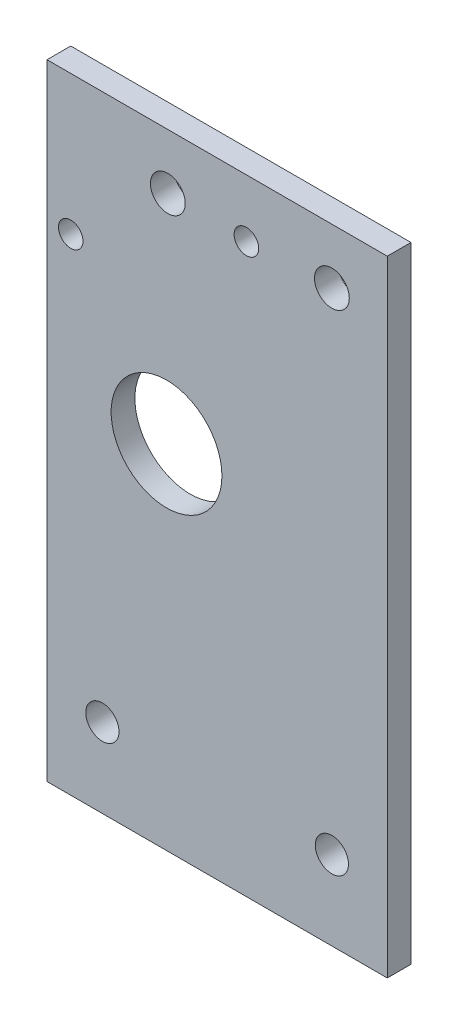
ISO-10303-21;
HEADER;
FILE_DESCRIPTION(('STEP AP214'),'2;1');
FILE_NAME('part.step','',(''),(''),'','','');
FILE_SCHEMA(('AUTOMOTIVE_DESIGN { 1 0 10303 214 1 1 1 1 }'));
ENDSEC;
DATA;
#1=APPLICATION_CONTEXT('core data for automotive mechanical design processes');
#2=APPLICATION_PROTOCOL_DEFINITION('international standard','automotive_design',2000,#1);
#3=PRODUCT_CONTEXT('',#1,'mechanical');
#4=PRODUCT('Part','Part','',(#3));
#5=PRODUCT_RELATED_PRODUCT_CATEGORY('part','',(#4));
#6=PRODUCT_DEFINITION_FORMATION('','',#4);
#7=PRODUCT_DEFINITION_CONTEXT('part definition',#1,'design');
#8=PRODUCT_DEFINITION('design','',#6,#7);
#9=PRODUCT_DEFINITION_SHAPE('','',#8);
#10=(LENGTH_UNIT() NAMED_UNIT(*) SI_UNIT(.MILLI.,.METRE.));
#11=(NAMED_UNIT(*) PLANE_ANGLE_UNIT() SI_UNIT($,.RADIAN.));
#12=(NAMED_UNIT(*) SI_UNIT($,.STERADIAN.) SOLID_ANGLE_UNIT());
#13=UNCERTAINTY_MEASURE_WITH_UNIT(LENGTH_MEASURE(1.E-05),#10,'distance_accuracy_value','');
#14=(GEOMETRIC_REPRESENTATION_CONTEXT(3) GLOBAL_UNCERTAINTY_ASSIGNED_CONTEXT((#13)) GLOBAL_UNIT_ASSIGNED_CONTEXT((#10,
#11,#12)) REPRESENTATION_CONTEXT('',''));
#15=CARTESIAN_POINT('',(0.,0.,0.));
#16=DIRECTION('',(0.,0.,1.));
#17=DIRECTION('',(1.,0.,0.));
#18=AXIS2_PLACEMENT_3D('',#15,#16,#17);
#19=CARTESIAN_POINT('',(0.,0.,3.));
#20=DIRECTION('',(0.,0.,1.));
#21=DIRECTION('',(1.,0.,0.));
#22=AXIS2_PLACEMENT_3D('',#19,#20,#21);
#23=PLANE('',#22);
#24=CARTESIAN_POINT('',(24.,16.9055371087257,3.));
#25=DIRECTION('',(0.,0.,-1.));
#26=DIRECTION('',(-1.,0.,0.));
#27=AXIS2_PLACEMENT_3D('',#24,#25,#26);
#28=CIRCLE('',#27,1.55);
#29=CARTESIAN_POINT('',(22.45,16.9055371087257,3.));
#30=VERTEX_POINT('',#29);
#31=EDGE_CURVE('E120',#30,#30,#28,.T.);
#32=ORIENTED_EDGE('',*,*,#31,.T.);
#33=EDGE_LOOP('',(#32));
#34=FACE_BOUND('',#33,.T.);
#35=CARTESIAN_POINT('',(46.2,27.2055371087257,3.));
#36=DIRECTION('',(0.,0.,-1.));
#37=DIRECTION('',(-1.,0.,0.));
#38=AXIS2_PLACEMENT_3D('',#35,#36,#37);
#39=CIRCLE('',#38,1.55);
#40=CARTESIAN_POINT('',(44.65,27.2055371087257,3.));
#41=VERTEX_POINT('',#40);
#42=EDGE_CURVE('E126',#41,#41,#39,.T.);
#43=ORIENTED_EDGE('',*,*,#42,.T.);
#44=EDGE_LOOP('',(#43));
#45=FACE_BOUND('',#44,.T.);
#46=CARTESIAN_POINT('',(36.27,27.5,3.));
#47=DIRECTION('',(0.,0.,1.));
#48=DIRECTION('',(1.,0.,0.));
#49=AXIS2_PLACEMENT_3D('',#46,#47,#48);
#50=CIRCLE('',#49,2.2);
#51=CARTESIAN_POINT('',(38.47,27.5,3.));
#52=VERTEX_POINT('',#51);
#53=EDGE_CURVE('E82',#52,#52,#50,.T.);
#54=ORIENTED_EDGE('',*,*,#53,.F.);
#55=EDGE_LOOP('',(#54));
#56=FACE_BOUND('',#55,.T.);
#57=CARTESIAN_POINT('',(57.0000000000001,27.5,3.));
#58=DIRECTION('',(0.,0.,1.));
#59=DIRECTION('',(1.,0.,0.));
#60=AXIS2_PLACEMENT_3D('',#57,#58,#59);
#61=CIRCLE('',#60,2.2);
#62=CARTESIAN_POINT('',(59.2000000000001,27.5,3.));
#63=VERTEX_POINT('',#62);
#64=EDGE_CURVE('E136',#63,#63,#61,.T.);
#65=ORIENTED_EDGE('',*,*,#64,.F.);
#66=EDGE_LOOP('',(#65));
#67=FACE_BOUND('',#66,.T.);
#68=CARTESIAN_POINT('',(28.,-34.5,3.));
#69=DIRECTION('',(0.,0.,1.));
#70=DIRECTION('',(1.,0.,0.));
#71=AXIS2_PLACEMENT_3D('',#68,#69,#70);
#72=CIRCLE('',#71,2.1);
#73=CARTESIAN_POINT('',(30.1,-34.5,3.));
#74=VERTEX_POINT('',#73);
#75=EDGE_CURVE('E116',#74,#74,#72,.T.);
#76=ORIENTED_EDGE('',*,*,#75,.F.);
#77=EDGE_LOOP('',(#76));
#78=FACE_BOUND('',#77,.T.);
#79=CARTESIAN_POINT('',(57.,-34.5,3.));
#80=DIRECTION('',(0.,0.,1.));
#81=DIRECTION('',(1.,0.,0.));
#82=AXIS2_PLACEMENT_3D('',#79,#80,#81);
#83=CIRCLE('',#82,2.1);
#84=CARTESIAN_POINT('',(59.1,-34.5,3.));
#85=VERTEX_POINT('',#84);
#86=EDGE_CURVE('E145',#85,#85,#83,.T.);
#87=ORIENTED_EDGE('',*,*,#86,.F.);
#88=EDGE_LOOP('',(#87));
#89=FACE_BOUND('',#88,.T.);
#90=CARTESIAN_POINT('',(36.1057978598848,0.,3.));
#91=DIRECTION('',(0.,0.,1.));
#92=DIRECTION('',(1.,0.,0.));
#93=AXIS2_PLACEMENT_3D('',#90,#91,#92);
#94=CIRCLE('',#93,7.);
#95=CARTESIAN_POINT('',(43.1057978598848,0.,3.));
#96=VERTEX_POINT('',#95);
#97=EDGE_CURVE('E94',#96,#96,#94,.T.);
#98=ORIENTED_EDGE('',*,*,#97,.F.);
#99=EDGE_LOOP('',(#98));
#100=FACE_BOUND('',#99,.T.);
#101=DIRECTION('',(0.,1.,0.));
#102=VECTOR('',#101,1.);
#103=CARTESIAN_POINT('',(21.,-34.5,3.));
#104=LINE('',#103,#102);
#105=CARTESIAN_POINT('',(21.,-44.5,3.));
#106=VERTEX_POINT('',#105);
#107=CARTESIAN_POINT('',(21.,34.5,3.));
#108=VERTEX_POINT('',#107);
#109=EDGE_CURVE('E60',#106,#108,#104,.T.);
#110=ORIENTED_EDGE('',*,*,#109,.F.);
#111=DIRECTION('',(-1.,0.,0.));
#112=VECTOR('',#111,1.);
#113=CARTESIAN_POINT('',(21.,-44.5,3.));
#114=LINE('',#113,#112);
#115=CARTESIAN_POINT('',(64.,-44.5,3.));
#116=VERTEX_POINT('',#115);
#117=EDGE_CURVE('E53',#116,#106,#114,.T.);
#118=ORIENTED_EDGE('',*,*,#117,.F.);
#119=DIRECTION('',(0.,-1.,0.));
#120=VECTOR('',#119,1.);
#121=CARTESIAN_POINT('',(64.,24.5,3.));
#122=LINE('',#121,#120);
#123=CARTESIAN_POINT('',(64.,34.5,3.));
#124=VERTEX_POINT('',#123);
#125=EDGE_CURVE('E11',#124,#116,#122,.T.);
#126=ORIENTED_EDGE('',*,*,#125,.F.);
#127=DIRECTION('',(1.,0.,0.));
#128=VECTOR('',#127,1.);
#129=CARTESIAN_POINT('',(-22.,34.5,3.));
#130=LINE('',#129,#128);
#131=EDGE_CURVE('E102',#108,#124,#130,.T.);
#132=ORIENTED_EDGE('',*,*,#131,.F.);
#133=EDGE_LOOP('',(#110,#118,#126,#132));
#134=FACE_BOUND('',#133,.T.);
#135=ADVANCED_FACE('F36',(#34,#45,#56,#67,#78,#89,#100,#134),#23,.T.);
#136=CARTESIAN_POINT('',(0.,0.,0.));
#137=DIRECTION('',(0.,0.,1.));
#138=DIRECTION('',(1.,0.,0.));
#139=AXIS2_PLACEMENT_3D('',#136,#137,#138);
#140=PLANE('',#139);
#141=CARTESIAN_POINT('',(24.,16.9055371087257,0.));
#142=DIRECTION('',(0.,0.,1.));
#143=DIRECTION('',(1.,0.,0.));
#144=AXIS2_PLACEMENT_3D('',#141,#142,#143);
#145=CIRCLE('',#144,1.55);
#146=CARTESIAN_POINT('',(25.55,16.9055371087257,0.));
#147=VERTEX_POINT('',#146);
#148=EDGE_CURVE('E40',#147,#147,#145,.T.);
#149=ORIENTED_EDGE('',*,*,#148,.T.);
#150=EDGE_LOOP('',(#149));
#151=FACE_BOUND('',#150,.T.);
#152=CARTESIAN_POINT('',(46.2,27.2055371087257,0.));
#153=DIRECTION('',(0.,0.,1.));
#154=DIRECTION('',(1.,0.,0.));
#155=AXIS2_PLACEMENT_3D('',#152,#153,#154);
#156=CIRCLE('',#155,1.55);
#157=CARTESIAN_POINT('',(47.75,27.2055371087257,0.));
#158=VERTEX_POINT('',#157);
#159=EDGE_CURVE('E118',#158,#158,#156,.T.);
#160=ORIENTED_EDGE('',*,*,#159,.T.);
#161=EDGE_LOOP('',(#160));
#162=FACE_BOUND('',#161,.T.);
#163=CARTESIAN_POINT('',(36.27,27.5,0.));
#164=DIRECTION('',(0.,0.,-1.));
#165=DIRECTION('',(-1.,0.,0.));
#166=AXIS2_PLACEMENT_3D('',#163,#164,#165);
#167=CIRCLE('',#166,2.2);
#168=CARTESIAN_POINT('',(34.07,27.5,0.));
#169=VERTEX_POINT('',#168);
#170=EDGE_CURVE('E133',#169,#169,#167,.T.);
#171=ORIENTED_EDGE('',*,*,#170,.F.);
#172=EDGE_LOOP('',(#171));
#173=FACE_BOUND('',#172,.T.);
#174=CARTESIAN_POINT('',(57.0000000000001,27.5,0.));
#175=DIRECTION('',(0.,0.,-1.));
#176=DIRECTION('',(-1.,0.,0.));
#177=AXIS2_PLACEMENT_3D('',#174,#175,#176);
#178=CIRCLE('',#177,2.2);
#179=CARTESIAN_POINT('',(54.8000000000001,27.5,0.));
#180=VERTEX_POINT('',#179);
#181=EDGE_CURVE('E124',#180,#180,#178,.T.);
#182=ORIENTED_EDGE('',*,*,#181,.F.);
#183=EDGE_LOOP('',(#182));
#184=FACE_BOUND('',#183,.T.);
#185=CARTESIAN_POINT('',(36.1057978598848,0.,0.));
#186=DIRECTION('',(0.,0.,1.));
#187=DIRECTION('',(1.,0.,0.));
#188=AXIS2_PLACEMENT_3D('',#185,#186,#187);
#189=CIRCLE('',#188,7.);
#190=CARTESIAN_POINT('',(43.1057978598848,0.,0.));
#191=VERTEX_POINT('',#190);
#192=EDGE_CURVE('E97',#191,#191,#189,.T.);
#193=ORIENTED_EDGE('',*,*,#192,.T.);
#194=EDGE_LOOP('',(#193));
#195=FACE_BOUND('',#194,.T.);
#196=CARTESIAN_POINT('',(57.,-34.5,0.));
#197=DIRECTION('',(0.,0.,1.));
#198=DIRECTION('',(1.,0.,0.));
#199=AXIS2_PLACEMENT_3D('',#196,#197,#198);
#200=CIRCLE('',#199,2.1);
#201=CARTESIAN_POINT('',(59.1,-34.5,0.));
#202=VERTEX_POINT('',#201);
#203=EDGE_CURVE('E112',#202,#202,#200,.T.);
#204=ORIENTED_EDGE('',*,*,#203,.T.);
#205=EDGE_LOOP('',(#204));
#206=FACE_BOUND('',#205,.T.);
#207=CARTESIAN_POINT('',(28.,-34.5,0.));
#208=DIRECTION('',(0.,0.,1.));
#209=DIRECTION('',(1.,0.,0.));
#210=AXIS2_PLACEMENT_3D('',#207,#208,#209);
#211=CIRCLE('',#210,2.1);
#212=CARTESIAN_POINT('',(30.1,-34.5,0.));
#213=VERTEX_POINT('',#212);
#214=EDGE_CURVE('E115',#213,#213,#211,.T.);
#215=ORIENTED_EDGE('',*,*,#214,.T.);
#216=EDGE_LOOP('',(#215));
#217=FACE_BOUND('',#216,.T.);
#218=DIRECTION('',(1.,0.,0.));
#219=VECTOR('',#218,1.);
#220=CARTESIAN_POINT('',(21.,-44.5,0.));
#221=LINE('',#220,#219);
#222=CARTESIAN_POINT('',(21.,-44.5,0.));
#223=VERTEX_POINT('',#222);
#224=CARTESIAN_POINT('',(64.,-44.5,0.));
#225=VERTEX_POINT('',#224);
#226=EDGE_CURVE('E79',#223,#225,#221,.T.);
#227=ORIENTED_EDGE('',*,*,#226,.F.);
#228=DIRECTION('',(0.,-1.,0.));
#229=VECTOR('',#228,1.);
#230=CARTESIAN_POINT('',(21.,-34.5,0.));
#231=LINE('',#230,#229);
#232=CARTESIAN_POINT('',(21.,34.5,0.));
#233=VERTEX_POINT('',#232);
#234=EDGE_CURVE('E88',#233,#223,#231,.T.);
#235=ORIENTED_EDGE('',*,*,#234,.F.);
#236=DIRECTION('',(-1.,0.,0.));
#237=VECTOR('',#236,1.);
#238=CARTESIAN_POINT('',(-22.,34.5,0.));
#239=LINE('',#238,#237);
#240=CARTESIAN_POINT('',(64.,34.5,0.));
#241=VERTEX_POINT('',#240);
#242=EDGE_CURVE('E107',#241,#233,#239,.T.);
#243=ORIENTED_EDGE('',*,*,#242,.F.);
#244=DIRECTION('',(0.,1.,0.));
#245=VECTOR('',#244,1.);
#246=CARTESIAN_POINT('',(64.,24.5,0.));
#247=LINE('',#246,#245);
#248=EDGE_CURVE('E45',#225,#241,#247,.T.);
#249=ORIENTED_EDGE('',*,*,#248,.F.);
#250=EDGE_LOOP('',(#227,#235,#243,#249));
#251=FACE_BOUND('',#250,.T.);
#252=ADVANCED_FACE('F38',(#151,#162,#173,#184,#195,#206,#217,#251),#140,.F.);
#253=CARTESIAN_POINT('',(64.,0.,0.));
#254=DIRECTION('',(-1.,0.,0.));
#255=DIRECTION('',(0.,0.,1.));
#256=AXIS2_PLACEMENT_3D('',#253,#254,#255);
#257=PLANE('',#256);
#258=DIRECTION('',(0.,0.,1.));
#259=VECTOR('',#258,1.);
#260=CARTESIAN_POINT('',(64.,-44.5,3.));
#261=LINE('',#260,#259);
#262=EDGE_CURVE('E90',#225,#116,#261,.T.);
#263=ORIENTED_EDGE('',*,*,#262,.F.);
#264=ORIENTED_EDGE('',*,*,#248,.T.);
#265=DIRECTION('',(0.,0.,-1.));
#266=VECTOR('',#265,1.);
#267=CARTESIAN_POINT('',(64.,34.5,0.));
#268=LINE('',#267,#266);
#269=EDGE_CURVE('E104',#124,#241,#268,.T.);
#270=ORIENTED_EDGE('',*,*,#269,.F.);
#271=ORIENTED_EDGE('',*,*,#125,.T.);
#272=EDGE_LOOP('',(#263,#264,#270,#271));
#273=FACE_BOUND('',#272,.T.);
#274=ADVANCED_FACE('F164',(#273),#257,.F.);
#275=CARTESIAN_POINT('',(21.,0.,0.));
#276=DIRECTION('',(-1.,0.,0.));
#277=DIRECTION('',(0.,-1.,0.));
#278=AXIS2_PLACEMENT_3D('',#275,#276,#277);
#279=PLANE('',#278);
#280=ORIENTED_EDGE('',*,*,#234,.T.);
#281=DIRECTION('',(0.,0.,-1.));
#282=VECTOR('',#281,1.);
#283=CARTESIAN_POINT('',(21.,-44.5,3.));
#284=LINE('',#283,#282);
#285=EDGE_CURVE('E76',#106,#223,#284,.T.);
#286=ORIENTED_EDGE('',*,*,#285,.F.);
#287=ORIENTED_EDGE('',*,*,#109,.T.);
#288=DIRECTION('',(0.,0.,-1.));
#289=VECTOR('',#288,1.);
#290=CARTESIAN_POINT('',(21.,34.5,3.));
#291=LINE('',#290,#289);
#292=EDGE_CURVE('E93',#108,#233,#291,.T.);
#293=ORIENTED_EDGE('',*,*,#292,.T.);
#294=EDGE_LOOP('',(#280,#286,#287,#293));
#295=FACE_BOUND('',#294,.T.);
#296=ADVANCED_FACE('F92',(#295),#279,.T.);
#297=CARTESIAN_POINT('',(0.,34.5,0.));
#298=DIRECTION('',(0.,1.,0.));
#299=DIRECTION('',(0.,0.,1.));
#300=AXIS2_PLACEMENT_3D('',#297,#298,#299);
#301=PLANE('',#300);
#302=ORIENTED_EDGE('',*,*,#242,.T.);
#303=ORIENTED_EDGE('',*,*,#292,.F.);
#304=ORIENTED_EDGE('',*,*,#131,.T.);
#305=ORIENTED_EDGE('',*,*,#269,.T.);
#306=EDGE_LOOP('',(#302,#303,#304,#305));
#307=FACE_BOUND('',#306,.T.);
#308=ADVANCED_FACE('F162',(#307),#301,.T.);
#309=CARTESIAN_POINT('',(36.1057978598848,0.,-7.));
#310=DIRECTION('',(0.,0.,1.));
#311=DIRECTION('',(1.,0.,0.));
#312=AXIS2_PLACEMENT_3D('',#309,#310,#311);
#313=CYLINDRICAL_SURFACE('',#312,7.);
#314=ORIENTED_EDGE('',*,*,#97,.T.);
#315=EDGE_LOOP('',(#314));
#316=FACE_BOUND('',#315,.T.);
#317=ORIENTED_EDGE('',*,*,#192,.F.);
#318=EDGE_LOOP('',(#317));
#319=FACE_BOUND('',#318,.T.);
#320=ADVANCED_FACE('F176',(#316,#319),#313,.F.);
#321=CARTESIAN_POINT('',(57.,-34.5,-7.));
#322=DIRECTION('',(0.,0.,1.));
#323=DIRECTION('',(1.,0.,0.));
#324=AXIS2_PLACEMENT_3D('',#321,#322,#323);
#325=CYLINDRICAL_SURFACE('',#324,2.1);
#326=ORIENTED_EDGE('',*,*,#86,.T.);
#327=EDGE_LOOP('',(#326));
#328=FACE_BOUND('',#327,.T.);
#329=ORIENTED_EDGE('',*,*,#203,.F.);
#330=EDGE_LOOP('',(#329));
#331=FACE_BOUND('',#330,.T.);
#332=ADVANCED_FACE('F151',(#328,#331),#325,.F.);
#333=CARTESIAN_POINT('',(28.,-34.5,-7.));
#334=DIRECTION('',(0.,0.,1.));
#335=DIRECTION('',(1.,0.,0.));
#336=AXIS2_PLACEMENT_3D('',#333,#334,#335);
#337=CYLINDRICAL_SURFACE('',#336,2.1);
#338=ORIENTED_EDGE('',*,*,#75,.T.);
#339=EDGE_LOOP('',(#338));
#340=FACE_BOUND('',#339,.T.);
#341=ORIENTED_EDGE('',*,*,#214,.F.);
#342=EDGE_LOOP('',(#341));
#343=FACE_BOUND('',#342,.T.);
#344=ADVANCED_FACE('F182',(#340,#343),#337,.F.);
#345=CARTESIAN_POINT('',(0.,-44.5,0.));
#346=DIRECTION('',(0.,-1.,0.));
#347=DIRECTION('',(0.,0.,-1.));
#348=AXIS2_PLACEMENT_3D('',#345,#346,#347);
#349=PLANE('',#348);
#350=ORIENTED_EDGE('',*,*,#285,.T.);
#351=ORIENTED_EDGE('',*,*,#226,.T.);
#352=ORIENTED_EDGE('',*,*,#262,.T.);
#353=ORIENTED_EDGE('',*,*,#117,.T.);
#354=EDGE_LOOP('',(#350,#351,#352,#353));
#355=FACE_BOUND('',#354,.T.);
#356=ADVANCED_FACE('F78',(#355),#349,.T.);
#357=CARTESIAN_POINT('',(57.0000000000001,27.5,30.));
#358=DIRECTION('',(0.,0.,-1.));
#359=DIRECTION('',(-1.,0.,0.));
#360=AXIS2_PLACEMENT_3D('',#357,#358,#359);
#361=CYLINDRICAL_SURFACE('',#360,2.2);
#362=ORIENTED_EDGE('',*,*,#64,.T.);
#363=EDGE_LOOP('',(#362));
#364=FACE_BOUND('',#363,.T.);
#365=ORIENTED_EDGE('',*,*,#181,.T.);
#366=EDGE_LOOP('',(#365));
#367=FACE_BOUND('',#366,.T.);
#368=ADVANCED_FACE('F188',(#364,#367),#361,.F.);
#369=CARTESIAN_POINT('',(36.27,27.5,30.));
#370=DIRECTION('',(0.,0.,-1.));
#371=DIRECTION('',(-1.,0.,0.));
#372=AXIS2_PLACEMENT_3D('',#369,#370,#371);
#373=CYLINDRICAL_SURFACE('',#372,2.2);
#374=ORIENTED_EDGE('',*,*,#53,.T.);
#375=EDGE_LOOP('',(#374));
#376=FACE_BOUND('',#375,.T.);
#377=ORIENTED_EDGE('',*,*,#170,.T.);
#378=EDGE_LOOP('',(#377));
#379=FACE_BOUND('',#378,.T.);
#380=ADVANCED_FACE('F191',(#376,#379),#373,.F.);
#381=CARTESIAN_POINT('',(46.2,27.2055371087257,3.));
#382=DIRECTION('',(0.,0.,-1.));
#383=DIRECTION('',(-1.,0.,0.));
#384=AXIS2_PLACEMENT_3D('',#381,#382,#383);
#385=CYLINDRICAL_SURFACE('',#384,1.55);
#386=ORIENTED_EDGE('',*,*,#42,.F.);
#387=EDGE_LOOP('',(#386));
#388=FACE_BOUND('',#387,.T.);
#389=ORIENTED_EDGE('',*,*,#159,.F.);
#390=EDGE_LOOP('',(#389));
#391=FACE_BOUND('',#390,.T.);
#392=ADVANCED_FACE('F195',(#388,#391),#385,.F.);
#393=CARTESIAN_POINT('',(24.,16.9055371087257,3.));
#394=DIRECTION('',(0.,0.,-1.));
#395=DIRECTION('',(-1.,0.,0.));
#396=AXIS2_PLACEMENT_3D('',#393,#394,#395);
#397=CYLINDRICAL_SURFACE('',#396,1.55);
#398=ORIENTED_EDGE('',*,*,#31,.F.);
#399=EDGE_LOOP('',(#398));
#400=FACE_BOUND('',#399,.T.);
#401=ORIENTED_EDGE('',*,*,#148,.F.);
#402=EDGE_LOOP('',(#401));
#403=FACE_BOUND('',#402,.T.);
#404=ADVANCED_FACE('F199',(#400,#403),#397,.F.);
#405=CLOSED_SHELL('',(#135,#252,#274,#296,#308,#320,#332,#344,#356,#368,#380,#392,#404));
#406=MANIFOLD_SOLID_BREP('B2',#405);
#407=ADVANCED_BREP_SHAPE_REPRESENTATION('',(#18,#406),#14);
#408=SHAPE_DEFINITION_REPRESENTATION(#9,#407);
ENDSEC;
END-ISO-10303-21;
